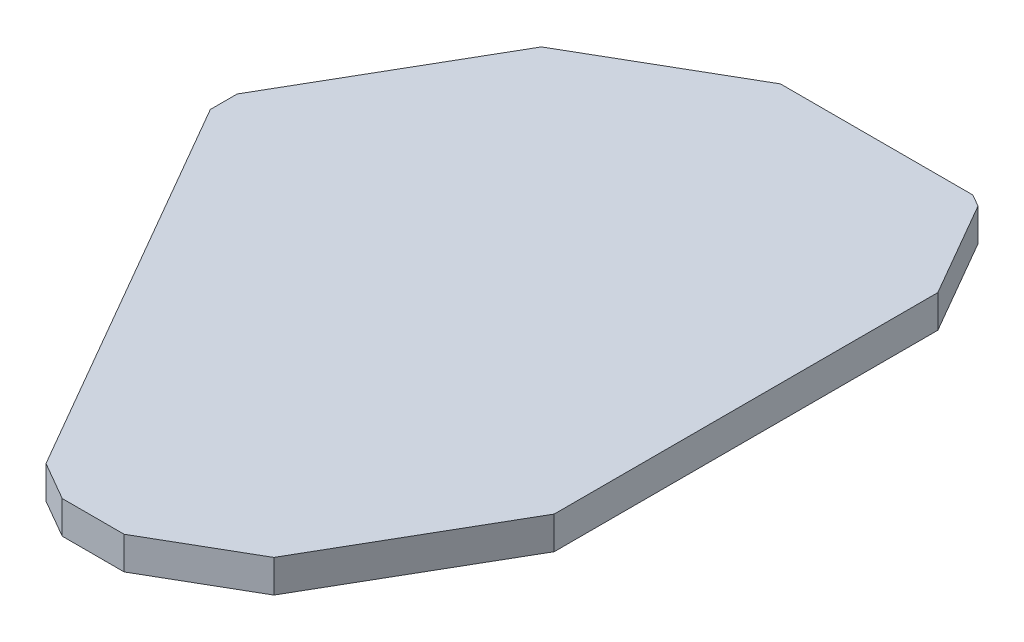
ISO-10303-21;
HEADER;
FILE_DESCRIPTION(('STEP AP214'),'2;1');
FILE_NAME('part.step','',(''),(''),'','','');
FILE_SCHEMA(('AUTOMOTIVE_DESIGN { 1 0 10303 214 1 1 1 1 }'));
ENDSEC;
DATA;
#1=APPLICATION_CONTEXT('core data for automotive mechanical design processes');
#2=APPLICATION_PROTOCOL_DEFINITION('international standard','automotive_design',2000,#1);
#3=PRODUCT_CONTEXT('',#1,'mechanical');
#4=PRODUCT('Part','Part','',(#3));
#5=PRODUCT_RELATED_PRODUCT_CATEGORY('part','',(#4));
#6=PRODUCT_DEFINITION_FORMATION('','',#4);
#7=PRODUCT_DEFINITION_CONTEXT('part definition',#1,'design');
#8=PRODUCT_DEFINITION('design','',#6,#7);
#9=PRODUCT_DEFINITION_SHAPE('','',#8);
#10=(LENGTH_UNIT() NAMED_UNIT(*) SI_UNIT(.MILLI.,.METRE.));
#11=(NAMED_UNIT(*) PLANE_ANGLE_UNIT() SI_UNIT($,.RADIAN.));
#12=(NAMED_UNIT(*) SI_UNIT($,.STERADIAN.) SOLID_ANGLE_UNIT());
#13=UNCERTAINTY_MEASURE_WITH_UNIT(LENGTH_MEASURE(1.E-05),#10,'distance_accuracy_value','');
#14=(GEOMETRIC_REPRESENTATION_CONTEXT(3) GLOBAL_UNCERTAINTY_ASSIGNED_CONTEXT((#13)) GLOBAL_UNIT_ASSIGNED_CONTEXT((#10,
#11,#12)) REPRESENTATION_CONTEXT('',''));
#15=CARTESIAN_POINT('',(0.,0.,0.));
#16=DIRECTION('',(0.,0.,1.));
#17=DIRECTION('',(1.,0.,0.));
#18=AXIS2_PLACEMENT_3D('',#15,#16,#17);
#19=CARTESIAN_POINT('',(-5.00000000000001,1.,-8.66025403784439));
#20=DIRECTION('',(-0.500000000000001,0.,-0.866025403784438));
#21=DIRECTION('',(-0.866025403784438,0.,0.500000000000001));
#22=AXIS2_PLACEMENT_3D('',#19,#20,#21);
#23=PLANE('',#22);
#24=DIRECTION('',(0.866025403784438,0.,-0.500000000000001));
#25=VECTOR('',#24,1.);
#26=CARTESIAN_POINT('',(-5.00000000000001,0.,-8.66025403784439));
#27=LINE('',#26,#25);
#28=CARTESIAN_POINT('',(-5.58845726811989,0.,-8.32050807568878));
#29=VERTEX_POINT('',#28);
#30=CARTESIAN_POINT('',(-0.947441116742357,0.,-11.));
#31=VERTEX_POINT('',#30);
#32=EDGE_CURVE('E152',#29,#31,#27,.T.);
#33=ORIENTED_EDGE('',*,*,#32,.F.);
#34=DIRECTION('',(0.,-1.,0.));
#35=VECTOR('',#34,1.);
#36=CARTESIAN_POINT('',(-5.58845726811989,1.,-8.32050807568878));
#37=LINE('',#36,#35);
#38=CARTESIAN_POINT('',(-5.58845726811989,1.,-8.32050807568878));
#39=VERTEX_POINT('',#38);
#40=EDGE_CURVE('E11',#39,#29,#37,.T.);
#41=ORIENTED_EDGE('',*,*,#40,.F.);
#42=DIRECTION('',(0.866025403784438,0.,-0.500000000000001));
#43=VECTOR('',#42,1.);
#44=CARTESIAN_POINT('',(-5.00000000000001,1.,-8.66025403784439));
#45=LINE('',#44,#43);
#46=CARTESIAN_POINT('',(-0.947441116742357,1.,-11.));
#47=VERTEX_POINT('',#46);
#48=EDGE_CURVE('E180',#39,#47,#45,.T.);
#49=ORIENTED_EDGE('',*,*,#48,.T.);
#50=DIRECTION('',(0.,-1.,0.));
#51=VECTOR('',#50,1.);
#52=CARTESIAN_POINT('',(-0.947441116742357,1.,-11.));
#53=LINE('',#52,#51);
#54=EDGE_CURVE('E51',#47,#31,#53,.T.);
#55=ORIENTED_EDGE('',*,*,#54,.T.);
#56=EDGE_LOOP('',(#33,#41,#49,#55));
#57=FACE_BOUND('',#56,.T.);
#58=ADVANCED_FACE('F35',(#57),#23,.T.);
#59=CARTESIAN_POINT('',(-7.79422863405994,1.,-4.50000000000001));
#60=DIRECTION('',(-0.866025403784438,0.,-0.500000000000001));
#61=DIRECTION('',(-0.500000000000001,0.,0.866025403784438));
#62=AXIS2_PLACEMENT_3D('',#59,#60,#61);
#63=PLANE('',#62);
#64=DIRECTION('',(0.500000000000001,0.,-0.866025403784438));
#65=VECTOR('',#64,1.);
#66=CARTESIAN_POINT('',(-7.79422863405994,0.,-4.50000000000001));
#67=LINE('',#66,#65);
#68=CARTESIAN_POINT('',(-9.,0.,-2.41154273188012));
#69=VERTEX_POINT('',#68);
#70=EDGE_CURVE('E154',#69,#29,#67,.T.);
#71=ORIENTED_EDGE('',*,*,#70,.F.);
#72=DIRECTION('',(0.,-1.,0.));
#73=VECTOR('',#72,1.);
#74=CARTESIAN_POINT('',(-9.,1.,-2.41154273188012));
#75=LINE('',#74,#73);
#76=CARTESIAN_POINT('',(-9.,1.,-2.41154273188012));
#77=VERTEX_POINT('',#76);
#78=EDGE_CURVE('E43',#77,#69,#75,.T.);
#79=ORIENTED_EDGE('',*,*,#78,.F.);
#80=DIRECTION('',(0.500000000000001,0.,-0.866025403784438));
#81=VECTOR('',#80,1.);
#82=CARTESIAN_POINT('',(-7.79422863405994,1.,-4.50000000000001));
#83=LINE('',#82,#81);
#84=EDGE_CURVE('E214',#77,#39,#83,.T.);
#85=ORIENTED_EDGE('',*,*,#84,.T.);
#86=ORIENTED_EDGE('',*,*,#40,.T.);
#87=EDGE_LOOP('',(#71,#79,#85,#86));
#88=FACE_BOUND('',#87,.T.);
#89=ADVANCED_FACE('F213',(#88),#63,.T.);
#90=CARTESIAN_POINT('',(-9.,1.,0.));
#91=DIRECTION('',(1.,0.,0.));
#92=DIRECTION('',(0.,0.,-1.));
#93=AXIS2_PLACEMENT_3D('',#90,#91,#92);
#94=PLANE('',#93);
#95=DIRECTION('',(0.,0.,1.));
#96=VECTOR('',#95,1.);
#97=CARTESIAN_POINT('',(-9.,0.,0.));
#98=LINE('',#97,#96);
#99=CARTESIAN_POINT('',(-9.,0.,-1.58845726811992));
#100=VERTEX_POINT('',#99);
#101=EDGE_CURVE('E157',#69,#100,#98,.T.);
#102=ORIENTED_EDGE('',*,*,#101,.T.);
#103=DIRECTION('',(0.,-1.,0.));
#104=VECTOR('',#103,1.);
#105=CARTESIAN_POINT('',(-9.,1.,-1.58845726811992));
#106=LINE('',#105,#104);
#107=CARTESIAN_POINT('',(-9.,1.,-1.58845726811992));
#108=VERTEX_POINT('',#107);
#109=EDGE_CURVE('E197',#108,#100,#106,.T.);
#110=ORIENTED_EDGE('',*,*,#109,.F.);
#111=DIRECTION('',(0.,0.,1.));
#112=VECTOR('',#111,1.);
#113=CARTESIAN_POINT('',(-9.,1.,0.));
#114=LINE('',#113,#112);
#115=EDGE_CURVE('E204',#77,#108,#114,.T.);
#116=ORIENTED_EDGE('',*,*,#115,.F.);
#117=ORIENTED_EDGE('',*,*,#78,.T.);
#118=EDGE_LOOP('',(#102,#110,#116,#117));
#119=FACE_BOUND('',#118,.T.);
#120=ADVANCED_FACE('F202',(#119),#94,.F.);
#121=CARTESIAN_POINT('',(-6.06217782649108,1.,3.49999999999999));
#122=DIRECTION('',(0.86602540378444,0.,-0.499999999999998));
#123=DIRECTION('',(-0.499999999999998,0.,-0.86602540378444));
#124=AXIS2_PLACEMENT_3D('',#121,#122,#123);
#125=PLANE('',#124);
#126=DIRECTION('',(0.499999999999998,0.,0.86602540378444));
#127=VECTOR('',#126,1.);
#128=CARTESIAN_POINT('',(-6.06217782649108,0.,3.49999999999999));
#129=LINE('',#128,#127);
#130=CARTESIAN_POINT('',(-2.12435565298216,0.,10.3205080756888));
#131=VERTEX_POINT('',#130);
#132=EDGE_CURVE('E159',#100,#131,#129,.T.);
#133=ORIENTED_EDGE('',*,*,#132,.T.);
#134=DIRECTION('',(0.,-1.,0.));
#135=VECTOR('',#134,1.);
#136=CARTESIAN_POINT('',(-2.12435565298216,1.,10.3205080756888));
#137=LINE('',#136,#135);
#138=CARTESIAN_POINT('',(-2.12435565298216,1.,10.3205080756888));
#139=VERTEX_POINT('',#138);
#140=EDGE_CURVE('E194',#139,#131,#137,.T.);
#141=ORIENTED_EDGE('',*,*,#140,.F.);
#142=DIRECTION('',(0.499999999999998,0.,0.86602540378444));
#143=VECTOR('',#142,1.);
#144=CARTESIAN_POINT('',(-6.06217782649108,1.,3.49999999999999));
#145=LINE('',#144,#143);
#146=EDGE_CURVE('E355',#108,#139,#145,.T.);
#147=ORIENTED_EDGE('',*,*,#146,.F.);
#148=ORIENTED_EDGE('',*,*,#109,.T.);
#149=EDGE_LOOP('',(#133,#141,#147,#148));
#150=FACE_BOUND('',#149,.T.);
#151=ADVANCED_FACE('F232',(#150),#125,.F.);
#152=CARTESIAN_POINT('',(-5.00000000000001,1.,8.66025403784438));
#153=DIRECTION('',(0.500000000000001,0.,-0.866025403784438));
#154=DIRECTION('',(-0.866025403784438,0.,-0.500000000000001));
#155=AXIS2_PLACEMENT_3D('',#152,#153,#154);
#156=PLANE('',#155);
#157=DIRECTION('',(0.866025403784438,0.,0.500000000000001));
#158=VECTOR('',#157,1.);
#159=CARTESIAN_POINT('',(-5.00000000000001,0.,8.66025403784438));
#160=LINE('',#159,#158);
#161=CARTESIAN_POINT('',(-0.947441116742349,0.,11.));
#162=VERTEX_POINT('',#161);
#163=EDGE_CURVE('E161',#131,#162,#160,.T.);
#164=ORIENTED_EDGE('',*,*,#163,.T.);
#165=DIRECTION('',(0.,-1.,0.));
#166=VECTOR('',#165,1.);
#167=CARTESIAN_POINT('',(-0.947441116742349,1.,11.));
#168=LINE('',#167,#166);
#169=CARTESIAN_POINT('',(-0.947441116742349,1.,11.));
#170=VERTEX_POINT('',#169);
#171=EDGE_CURVE('E191',#170,#162,#168,.T.);
#172=ORIENTED_EDGE('',*,*,#171,.F.);
#173=DIRECTION('',(0.866025403784438,0.,0.500000000000001));
#174=VECTOR('',#173,1.);
#175=CARTESIAN_POINT('',(-5.00000000000001,1.,8.66025403784438));
#176=LINE('',#175,#174);
#177=EDGE_CURVE('E353',#139,#170,#176,.T.);
#178=ORIENTED_EDGE('',*,*,#177,.F.);
#179=ORIENTED_EDGE('',*,*,#140,.T.);
#180=EDGE_LOOP('',(#164,#172,#178,#179));
#181=FACE_BOUND('',#180,.T.);
#182=ADVANCED_FACE('F237',(#181),#156,.F.);
#183=CARTESIAN_POINT('',(0.,1.,11.));
#184=DIRECTION('',(0.,0.,-1.));
#185=DIRECTION('',(-1.,0.,0.));
#186=AXIS2_PLACEMENT_3D('',#183,#184,#185);
#187=PLANE('',#186);
#188=DIRECTION('',(1.,0.,0.));
#189=VECTOR('',#188,1.);
#190=CARTESIAN_POINT('',(0.,0.,11.));
#191=LINE('',#190,#189);
#192=CARTESIAN_POINT('',(0.948564056742324,0.,11.));
#193=VERTEX_POINT('',#192);
#194=EDGE_CURVE('E163',#162,#193,#191,.T.);
#195=ORIENTED_EDGE('',*,*,#194,.T.);
#196=DIRECTION('',(0.,-1.,0.));
#197=VECTOR('',#196,1.);
#198=CARTESIAN_POINT('',(0.948564056742324,1.,11.));
#199=LINE('',#198,#197);
#200=CARTESIAN_POINT('',(0.948564056742324,1.,11.));
#201=VERTEX_POINT('',#200);
#202=EDGE_CURVE('E188',#201,#193,#199,.T.);
#203=ORIENTED_EDGE('',*,*,#202,.F.);
#204=DIRECTION('',(1.,0.,0.));
#205=VECTOR('',#204,1.);
#206=CARTESIAN_POINT('',(0.,1.,11.));
#207=LINE('',#206,#205);
#208=EDGE_CURVE('E349',#170,#201,#207,.T.);
#209=ORIENTED_EDGE('',*,*,#208,.F.);
#210=ORIENTED_EDGE('',*,*,#171,.T.);
#211=EDGE_LOOP('',(#195,#203,#209,#210));
#212=FACE_BOUND('',#211,.T.);
#213=ADVANCED_FACE('F241',(#212),#187,.F.);
#214=CARTESIAN_POINT('',(5.00028073499998,1.,8.66074028512786));
#215=DIRECTION('',(-0.499999999999998,0.,-0.86602540378444));
#216=DIRECTION('',(-0.86602540378444,0.,0.499999999999998));
#217=AXIS2_PLACEMENT_3D('',#214,#215,#216);
#218=PLANE('',#217);
#219=DIRECTION('',(0.86602540378444,0.,-0.499999999999998));
#220=VECTOR('',#219,1.);
#221=CARTESIAN_POINT('',(5.00028073499998,0.,8.66074028512786));
#222=LINE('',#221,#220);
#223=CARTESIAN_POINT('',(3.855844990551,0.,9.3214805702557));
#224=VERTEX_POINT('',#223);
#225=EDGE_CURVE('E165',#193,#224,#222,.T.);
#226=ORIENTED_EDGE('',*,*,#225,.T.);
#227=DIRECTION('',(0.,-1.,0.));
#228=VECTOR('',#227,1.);
#229=CARTESIAN_POINT('',(3.855844990551,1.,9.3214805702557));
#230=LINE('',#229,#228);
#231=CARTESIAN_POINT('',(3.855844990551,1.,9.3214805702557));
#232=VERTEX_POINT('',#231);
#233=EDGE_CURVE('E186',#232,#224,#230,.T.);
#234=ORIENTED_EDGE('',*,*,#233,.F.);
#235=DIRECTION('',(0.86602540378444,0.,-0.499999999999998));
#236=VECTOR('',#235,1.);
#237=CARTESIAN_POINT('',(5.00028073499998,1.,8.66074028512786));
#238=LINE('',#237,#236);
#239=EDGE_CURVE('E347',#201,#232,#238,.T.);
#240=ORIENTED_EDGE('',*,*,#239,.F.);
#241=ORIENTED_EDGE('',*,*,#202,.T.);
#242=EDGE_LOOP('',(#226,#234,#240,#241));
#243=FACE_BOUND('',#242,.T.);
#244=ADVANCED_FACE('F245',(#243),#218,.F.);
#245=CARTESIAN_POINT('',(6.9282032302755,1.,4.00000000000003));
#246=DIRECTION('',(0.866025403784437,0.,0.500000000000004));
#247=DIRECTION('',(0.500000000000004,0.,-0.866025403784437));
#248=AXIS2_PLACEMENT_3D('',#245,#246,#247);
#249=PLANE('',#248);
#250=DIRECTION('',(-0.500000000000004,0.,0.866025403784437));
#251=VECTOR('',#250,1.);
#252=CARTESIAN_POINT('',(6.9282032302755,0.,4.00000000000003));
#253=LINE('',#252,#251);
#254=CARTESIAN_POINT('',(7.,0.,3.87564434701787));
#255=VERTEX_POINT('',#254);
#256=EDGE_CURVE('E168',#255,#224,#253,.T.);
#257=ORIENTED_EDGE('',*,*,#256,.F.);
#258=DIRECTION('',(0.,-1.,0.));
#259=VECTOR('',#258,1.);
#260=CARTESIAN_POINT('',(7.,1.,3.87564434701787));
#261=LINE('',#260,#259);
#262=CARTESIAN_POINT('',(7.,1.,3.87564434701787));
#263=VERTEX_POINT('',#262);
#264=EDGE_CURVE('E184',#263,#255,#261,.T.);
#265=ORIENTED_EDGE('',*,*,#264,.F.);
#266=DIRECTION('',(-0.500000000000004,0.,0.866025403784437));
#267=VECTOR('',#266,1.);
#268=CARTESIAN_POINT('',(6.9282032302755,1.,4.00000000000003));
#269=LINE('',#268,#267);
#270=EDGE_CURVE('E344',#263,#232,#269,.T.);
#271=ORIENTED_EDGE('',*,*,#270,.T.);
#272=ORIENTED_EDGE('',*,*,#233,.T.);
#273=EDGE_LOOP('',(#257,#265,#271,#272));
#274=FACE_BOUND('',#273,.T.);
#275=ADVANCED_FACE('F249',(#274),#249,.T.);
#276=CARTESIAN_POINT('',(7.,1.,0.));
#277=DIRECTION('',(1.,0.,0.));
#278=DIRECTION('',(0.,0.,-1.));
#279=AXIS2_PLACEMENT_3D('',#276,#277,#278);
#280=PLANE('',#279);
#281=DIRECTION('',(0.,0.,1.));
#282=VECTOR('',#281,1.);
#283=CARTESIAN_POINT('',(7.,0.,0.));
#284=LINE('',#283,#282);
#285=CARTESIAN_POINT('',(7.,0.,-7.87564434701787));
#286=VERTEX_POINT('',#285);
#287=EDGE_CURVE('E171',#286,#255,#284,.T.);
#288=ORIENTED_EDGE('',*,*,#287,.F.);
#289=DIRECTION('',(0.,-1.,0.));
#290=VECTOR('',#289,1.);
#291=CARTESIAN_POINT('',(7.,1.,-7.87564434701787));
#292=LINE('',#291,#290);
#293=CARTESIAN_POINT('',(7.,1.,-7.87564434701787));
#294=VERTEX_POINT('',#293);
#295=EDGE_CURVE('E134',#294,#286,#292,.T.);
#296=ORIENTED_EDGE('',*,*,#295,.F.);
#297=DIRECTION('',(0.,0.,1.));
#298=VECTOR('',#297,1.);
#299=CARTESIAN_POINT('',(7.,1.,0.));
#300=LINE('',#299,#298);
#301=EDGE_CURVE('E144',#294,#263,#300,.T.);
#302=ORIENTED_EDGE('',*,*,#301,.T.);
#303=ORIENTED_EDGE('',*,*,#264,.T.);
#304=EDGE_LOOP('',(#288,#296,#302,#303));
#305=FACE_BOUND('',#304,.T.);
#306=ADVANCED_FACE('F253',(#305),#280,.T.);
#307=CARTESIAN_POINT('',(8.6602540378444,1.,-4.99999999999999));
#308=DIRECTION('',(0.866025403784439,0.,-0.499999999999999));
#309=DIRECTION('',(-0.499999999999999,0.,-0.86602540378444));
#310=AXIS2_PLACEMENT_3D('',#307,#308,#309);
#311=PLANE('',#310);
#312=DIRECTION('',(0.499999999999999,0.,0.86602540378444));
#313=VECTOR('',#312,1.);
#314=CARTESIAN_POINT('',(8.6602540378444,0.,-4.99999999999999));
#315=LINE('',#314,#313);
#316=CARTESIAN_POINT('',(5.32050807568879,0.,-10.7846096908265));
#317=VERTEX_POINT('',#316);
#318=EDGE_CURVE('E130',#317,#286,#315,.T.);
#319=ORIENTED_EDGE('',*,*,#318,.F.);
#320=DIRECTION('',(0.,-1.,0.));
#321=VECTOR('',#320,1.);
#322=CARTESIAN_POINT('',(5.32050807568879,1.,-10.7846096908265));
#323=LINE('',#322,#321);
#324=CARTESIAN_POINT('',(5.32050807568879,1.,-10.7846096908265));
#325=VERTEX_POINT('',#324);
#326=EDGE_CURVE('E125',#325,#317,#323,.T.);
#327=ORIENTED_EDGE('',*,*,#326,.F.);
#328=DIRECTION('',(0.499999999999999,0.,0.86602540378444));
#329=VECTOR('',#328,1.);
#330=CARTESIAN_POINT('',(8.6602540378444,1.,-4.99999999999999));
#331=LINE('',#330,#329);
#332=EDGE_CURVE('E128',#325,#294,#331,.T.);
#333=ORIENTED_EDGE('',*,*,#332,.T.);
#334=ORIENTED_EDGE('',*,*,#295,.T.);
#335=EDGE_LOOP('',(#319,#327,#333,#334));
#336=FACE_BOUND('',#335,.T.);
#337=ADVANCED_FACE('F127',(#336),#311,.T.);
#338=CARTESIAN_POINT('',(6.00000000000003,1.,-10.3923048454132));
#339=DIRECTION('',(0.500000000000003,0.,-0.866025403784437));
#340=DIRECTION('',(-0.866025403784437,0.,-0.500000000000003));
#341=AXIS2_PLACEMENT_3D('',#338,#339,#340);
#342=PLANE('',#341);
#343=DIRECTION('',(0.866025403784437,0.,0.500000000000002));
#344=VECTOR('',#343,1.);
#345=CARTESIAN_POINT('',(6.00000000000003,0.,-10.3923048454132));
#346=LINE('',#345,#344);
#347=CARTESIAN_POINT('',(4.94744111674236,0.,-11.));
#348=VERTEX_POINT('',#347);
#349=EDGE_CURVE('E175',#348,#317,#346,.T.);
#350=ORIENTED_EDGE('',*,*,#349,.F.);
#351=DIRECTION('',(0.,-1.,0.));
#352=VECTOR('',#351,1.);
#353=CARTESIAN_POINT('',(4.94744111674236,1.,-11.));
#354=LINE('',#353,#352);
#355=CARTESIAN_POINT('',(4.94744111674236,1.,-11.));
#356=VERTEX_POINT('',#355);
#357=EDGE_CURVE('E88',#356,#348,#354,.T.);
#358=ORIENTED_EDGE('',*,*,#357,.F.);
#359=DIRECTION('',(0.866025403784437,0.,0.500000000000002));
#360=VECTOR('',#359,1.);
#361=CARTESIAN_POINT('',(6.00000000000003,1.,-10.3923048454132));
#362=LINE('',#361,#360);
#363=EDGE_CURVE('E141',#356,#325,#362,.T.);
#364=ORIENTED_EDGE('',*,*,#363,.T.);
#365=ORIENTED_EDGE('',*,*,#326,.T.);
#366=EDGE_LOOP('',(#350,#358,#364,#365));
#367=FACE_BOUND('',#366,.T.);
#368=ADVANCED_FACE('F146',(#367),#342,.T.);
#369=CARTESIAN_POINT('',(0.,1.,-11.));
#370=DIRECTION('',(0.,0.,-1.));
#371=DIRECTION('',(-1.,0.,0.));
#372=AXIS2_PLACEMENT_3D('',#369,#370,#371);
#373=PLANE('',#372);
#374=DIRECTION('',(1.,0.,0.));
#375=VECTOR('',#374,1.);
#376=CARTESIAN_POINT('',(0.,0.,-11.));
#377=LINE('',#376,#375);
#378=EDGE_CURVE('E177',#31,#348,#377,.T.);
#379=ORIENTED_EDGE('',*,*,#378,.F.);
#380=ORIENTED_EDGE('',*,*,#54,.F.);
#381=DIRECTION('',(1.,0.,0.));
#382=VECTOR('',#381,1.);
#383=CARTESIAN_POINT('',(0.,1.,-11.));
#384=LINE('',#383,#382);
#385=EDGE_CURVE('E147',#47,#356,#384,.T.);
#386=ORIENTED_EDGE('',*,*,#385,.T.);
#387=ORIENTED_EDGE('',*,*,#357,.T.);
#388=EDGE_LOOP('',(#379,#380,#386,#387));
#389=FACE_BOUND('',#388,.T.);
#390=ADVANCED_FACE('F215',(#389),#373,.T.);
#391=CARTESIAN_POINT('',(0.,1.,0.));
#392=DIRECTION('',(0.,1.,0.));
#393=DIRECTION('',(0.,0.,1.));
#394=AXIS2_PLACEMENT_3D('',#391,#392,#393);
#395=PLANE('',#394);
#396=ORIENTED_EDGE('',*,*,#48,.F.);
#397=ORIENTED_EDGE('',*,*,#84,.F.);
#398=ORIENTED_EDGE('',*,*,#115,.T.);
#399=ORIENTED_EDGE('',*,*,#146,.T.);
#400=ORIENTED_EDGE('',*,*,#177,.T.);
#401=ORIENTED_EDGE('',*,*,#208,.T.);
#402=ORIENTED_EDGE('',*,*,#239,.T.);
#403=ORIENTED_EDGE('',*,*,#270,.F.);
#404=ORIENTED_EDGE('',*,*,#301,.F.);
#405=ORIENTED_EDGE('',*,*,#332,.F.);
#406=ORIENTED_EDGE('',*,*,#363,.F.);
#407=ORIENTED_EDGE('',*,*,#385,.F.);
#408=EDGE_LOOP('',(#396,#397,#398,#399,#400,#401,#402,#403,#404,#405,#406,#407));
#409=FACE_BOUND('',#408,.T.);
#410=ADVANCED_FACE('F139',(#409),#395,.T.);
#411=CARTESIAN_POINT('',(0.,0.,0.));
#412=DIRECTION('',(0.,1.,0.));
#413=DIRECTION('',(0.,0.,1.));
#414=AXIS2_PLACEMENT_3D('',#411,#412,#413);
#415=PLANE('',#414);
#416=ORIENTED_EDGE('',*,*,#32,.T.);
#417=ORIENTED_EDGE('',*,*,#378,.T.);
#418=ORIENTED_EDGE('',*,*,#349,.T.);
#419=ORIENTED_EDGE('',*,*,#318,.T.);
#420=ORIENTED_EDGE('',*,*,#287,.T.);
#421=ORIENTED_EDGE('',*,*,#256,.T.);
#422=ORIENTED_EDGE('',*,*,#225,.F.);
#423=ORIENTED_EDGE('',*,*,#194,.F.);
#424=ORIENTED_EDGE('',*,*,#163,.F.);
#425=ORIENTED_EDGE('',*,*,#132,.F.);
#426=ORIENTED_EDGE('',*,*,#101,.F.);
#427=ORIENTED_EDGE('',*,*,#70,.T.);
#428=EDGE_LOOP('',(#416,#417,#418,#419,#420,#421,#422,#423,#424,#425,#426,#427));
#429=FACE_BOUND('',#428,.T.);
#430=ADVANCED_FACE('F211',(#429),#415,.F.);
#431=CLOSED_SHELL('',(#58,#89,#120,#151,#182,#213,#244,#275,#306,#337,#368,#390,#410,#430));
#432=MANIFOLD_SOLID_BREP('B2',#431);
#433=ADVANCED_BREP_SHAPE_REPRESENTATION('',(#18,#432),#14);
#434=SHAPE_DEFINITION_REPRESENTATION(#9,#433);
ENDSEC;
END-ISO-10303-21;
